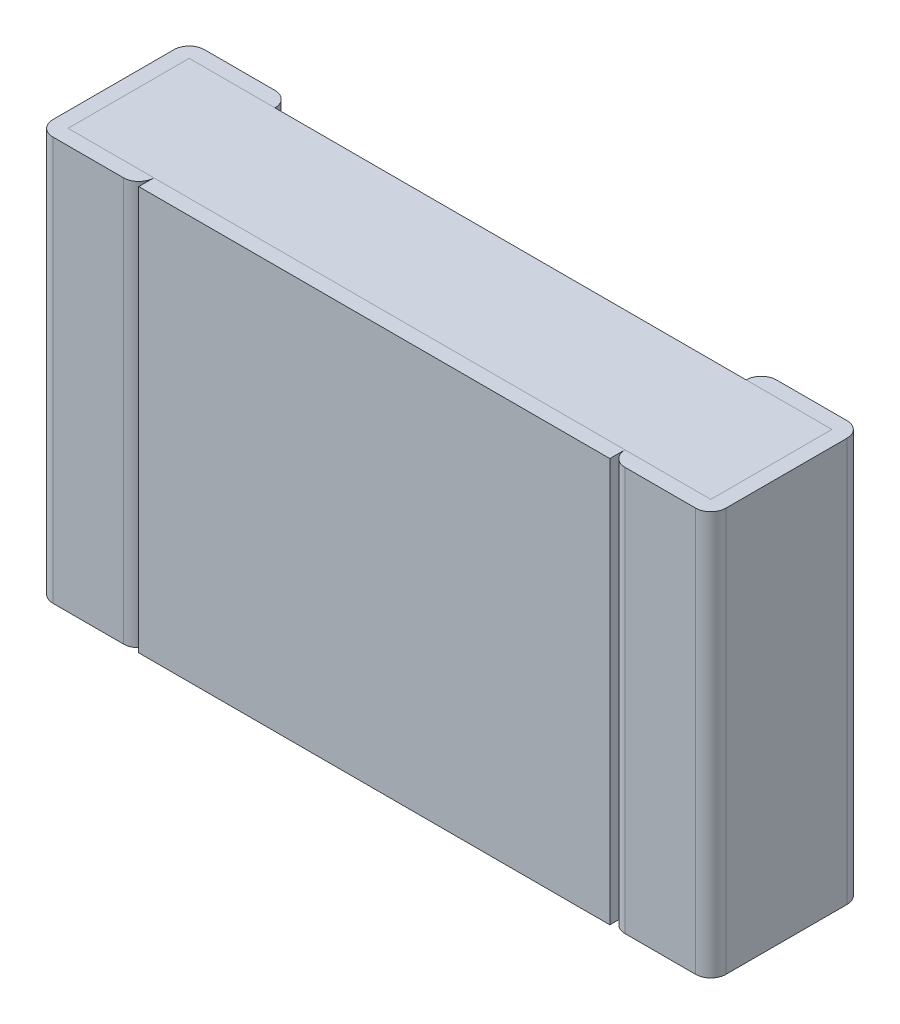
ISO-10303-21;
HEADER;
FILE_DESCRIPTION(('STEP AP214'),'2;1');
FILE_NAME('part.step','',(''),(''),'','','');
FILE_SCHEMA(('AUTOMOTIVE_DESIGN { 1 0 10303 214 1 1 1 1 }'));
ENDSEC;
DATA;
#1=APPLICATION_CONTEXT('core data for automotive mechanical design processes');
#2=APPLICATION_PROTOCOL_DEFINITION('international standard','automotive_design',2000,#1);
#3=PRODUCT_CONTEXT('',#1,'mechanical');
#4=PRODUCT('Part','Part','',(#3));
#5=PRODUCT_RELATED_PRODUCT_CATEGORY('part','',(#4));
#6=PRODUCT_DEFINITION_FORMATION('','',#4);
#7=PRODUCT_DEFINITION_CONTEXT('part definition',#1,'design');
#8=PRODUCT_DEFINITION('design','',#6,#7);
#9=PRODUCT_DEFINITION_SHAPE('','',#8);
#10=(LENGTH_UNIT() NAMED_UNIT(*) SI_UNIT(.MILLI.,.METRE.));
#11=(NAMED_UNIT(*) PLANE_ANGLE_UNIT() SI_UNIT($,.RADIAN.));
#12=(NAMED_UNIT(*) SI_UNIT($,.STERADIAN.) SOLID_ANGLE_UNIT());
#13=UNCERTAINTY_MEASURE_WITH_UNIT(LENGTH_MEASURE(1.E-05),#10,'distance_accuracy_value','');
#14=(GEOMETRIC_REPRESENTATION_CONTEXT(3) GLOBAL_UNCERTAINTY_ASSIGNED_CONTEXT((#13)) GLOBAL_UNIT_ASSIGNED_CONTEXT((#10,
#11,#12)) REPRESENTATION_CONTEXT('',''));
#15=CARTESIAN_POINT('',(0.,0.,0.));
#16=DIRECTION('',(0.,0.,1.));
#17=DIRECTION('',(1.,0.,0.));
#18=AXIS2_PLACEMENT_3D('',#15,#16,#17);
#19=CARTESIAN_POINT('',(-1.,-0.6,0.));
#20=DIRECTION('',(1.,0.,0.));
#21=DIRECTION('',(0.,1.,0.));
#22=AXIS2_PLACEMENT_3D('',#19,#20,#21);
#23=PLANE('',#22);
#24=DIRECTION('',(0.,1.,0.));
#25=VECTOR('',#24,1.);
#26=CARTESIAN_POINT('',(-1.,-0.6,0.405));
#27=LINE('',#26,#25);
#28=CARTESIAN_POINT('',(-1.,-0.6,0.405));
#29=VERTEX_POINT('',#28);
#30=CARTESIAN_POINT('',(-1.,0.6,0.405));
#31=VERTEX_POINT('',#30);
#32=EDGE_CURVE('E11',#29,#31,#27,.T.);
#33=ORIENTED_EDGE('',*,*,#32,.T.);
#34=DIRECTION('',(0.,0.,1.));
#35=VECTOR('',#34,1.);
#36=CARTESIAN_POINT('',(-1.,0.6,0.));
#37=LINE('',#36,#35);
#38=CARTESIAN_POINT('',(-1.,0.6,0.045));
#39=VERTEX_POINT('',#38);
#40=EDGE_CURVE('E40',#39,#31,#37,.T.);
#41=ORIENTED_EDGE('',*,*,#40,.F.);
#42=DIRECTION('',(0.,1.,0.));
#43=VECTOR('',#42,1.);
#44=CARTESIAN_POINT('',(-1.,-0.6,0.045));
#45=LINE('',#44,#43);
#46=CARTESIAN_POINT('',(-1.,-0.6,0.045));
#47=VERTEX_POINT('',#46);
#48=EDGE_CURVE('E267',#47,#39,#45,.T.);
#49=ORIENTED_EDGE('',*,*,#48,.F.);
#50=DIRECTION('',(0.,0.,1.));
#51=VECTOR('',#50,1.);
#52=CARTESIAN_POINT('',(-1.,-0.6,0.));
#53=LINE('',#52,#51);
#54=EDGE_CURVE('E27',#47,#29,#53,.T.);
#55=ORIENTED_EDGE('',*,*,#54,.T.);
#56=EDGE_LOOP('',(#33,#41,#49,#55));
#57=FACE_BOUND('',#56,.T.);
#58=ADVANCED_FACE('F16',(#57),#23,.F.);
#59=CARTESIAN_POINT('',(-1.,-0.6,0.));
#60=DIRECTION('',(0.,1.,0.));
#61=DIRECTION('',(1.,0.,0.));
#62=AXIS2_PLACEMENT_3D('',#59,#60,#61);
#63=PLANE('',#62);
#64=CARTESIAN_POINT('',(-0.745,-0.6,0.045));
#65=DIRECTION('',(0.,1.,0.));
#66=DIRECTION('',(0.,0.,1.));
#67=AXIS2_PLACEMENT_3D('',#64,#65,#66);
#68=CIRCLE('',#67,0.045);
#69=CARTESIAN_POINT('',(-0.7,-0.6,0.045));
#70=VERTEX_POINT('',#69);
#71=CARTESIAN_POINT('',(-0.745,-0.6,0.));
#72=VERTEX_POINT('',#71);
#73=EDGE_CURVE('E316',#70,#72,#68,.T.);
#74=ORIENTED_EDGE('',*,*,#73,.F.);
#75=DIRECTION('',(1.,0.,0.));
#76=VECTOR('',#75,1.);
#77=CARTESIAN_POINT('',(-0.955,-0.6,0.045));
#78=LINE('',#77,#76);
#79=CARTESIAN_POINT('',(-0.955,-0.6,0.045));
#80=VERTEX_POINT('',#79);
#81=EDGE_CURVE('E339',#80,#70,#78,.T.);
#82=ORIENTED_EDGE('',*,*,#81,.F.);
#83=DIRECTION('',(0.,0.,1.));
#84=VECTOR('',#83,1.);
#85=CARTESIAN_POINT('',(-0.955,-0.6,0.045));
#86=LINE('',#85,#84);
#87=CARTESIAN_POINT('',(-0.955,-0.6,0.405));
#88=VERTEX_POINT('',#87);
#89=EDGE_CURVE('E324',#80,#88,#86,.T.);
#90=ORIENTED_EDGE('',*,*,#89,.T.);
#91=DIRECTION('',(1.,0.,0.));
#92=VECTOR('',#91,1.);
#93=CARTESIAN_POINT('',(-0.955,-0.6,0.405));
#94=LINE('',#93,#92);
#95=CARTESIAN_POINT('',(-0.7,-0.6,0.405));
#96=VERTEX_POINT('',#95);
#97=EDGE_CURVE('E327',#88,#96,#94,.T.);
#98=ORIENTED_EDGE('',*,*,#97,.T.);
#99=CARTESIAN_POINT('',(-0.745,-0.6,0.405));
#100=DIRECTION('',(0.,-1.,0.));
#101=DIRECTION('',(0.,0.,1.));
#102=AXIS2_PLACEMENT_3D('',#99,#100,#101);
#103=CIRCLE('',#102,0.045);
#104=CARTESIAN_POINT('',(-0.745,-0.6,0.45));
#105=VERTEX_POINT('',#104);
#106=EDGE_CURVE('E345',#96,#105,#103,.T.);
#107=ORIENTED_EDGE('',*,*,#106,.T.);
#108=DIRECTION('',(1.,0.,0.));
#109=VECTOR('',#108,1.);
#110=CARTESIAN_POINT('',(-1.,-0.6,0.45));
#111=LINE('',#110,#109);
#112=CARTESIAN_POINT('',(-0.955,-0.6,0.45));
#113=VERTEX_POINT('',#112);
#114=EDGE_CURVE('E337',#113,#105,#111,.T.);
#115=ORIENTED_EDGE('',*,*,#114,.F.);
#116=CARTESIAN_POINT('',(-0.955,-0.6,0.405));
#117=DIRECTION('',(0.,1.,0.));
#118=DIRECTION('',(0.,0.,1.));
#119=AXIS2_PLACEMENT_3D('',#116,#117,#118);
#120=CIRCLE('',#119,0.045);
#121=EDGE_CURVE('E351',#29,#113,#120,.T.);
#122=ORIENTED_EDGE('',*,*,#121,.F.);
#123=ORIENTED_EDGE('',*,*,#54,.F.);
#124=CARTESIAN_POINT('',(-0.955,-0.6,0.045));
#125=DIRECTION('',(0.,-1.,0.));
#126=DIRECTION('',(0.,0.,1.));
#127=AXIS2_PLACEMENT_3D('',#124,#125,#126);
#128=CIRCLE('',#127,0.045);
#129=CARTESIAN_POINT('',(-0.955,-0.6,0.));
#130=VERTEX_POINT('',#129);
#131=EDGE_CURVE('E266',#47,#130,#128,.T.);
#132=ORIENTED_EDGE('',*,*,#131,.T.);
#133=DIRECTION('',(1.,0.,0.));
#134=VECTOR('',#133,1.);
#135=CARTESIAN_POINT('',(-1.,-0.6,0.));
#136=LINE('',#135,#134);
#137=EDGE_CURVE('E262',#130,#72,#136,.T.);
#138=ORIENTED_EDGE('',*,*,#137,.T.);
#139=EDGE_LOOP('',(#74,#82,#90,#98,#107,#115,#122,#123,#132,#138));
#140=FACE_BOUND('',#139,.T.);
#141=ADVANCED_FACE('F457',(#140),#63,.F.);
#142=CARTESIAN_POINT('',(-0.955,-0.6,0.045));
#143=DIRECTION('',(0.,1.,0.));
#144=DIRECTION('',(-1.,0.,0.));
#145=AXIS2_PLACEMENT_3D('',#142,#143,#144);
#146=CYLINDRICAL_SURFACE('',#145,0.045);
#147=ORIENTED_EDGE('',*,*,#48,.T.);
#148=CARTESIAN_POINT('',(-0.955,0.6,0.045));
#149=DIRECTION('',(0.,-1.,0.));
#150=DIRECTION('',(0.,0.,1.));
#151=AXIS2_PLACEMENT_3D('',#148,#149,#150);
#152=CIRCLE('',#151,0.045);
#153=CARTESIAN_POINT('',(-0.955,0.6,0.));
#154=VERTEX_POINT('',#153);
#155=EDGE_CURVE('E354',#39,#154,#152,.T.);
#156=ORIENTED_EDGE('',*,*,#155,.T.);
#157=DIRECTION('',(0.,1.,0.));
#158=VECTOR('',#157,1.);
#159=CARTESIAN_POINT('',(-0.955,-0.6,0.));
#160=LINE('',#159,#158);
#161=EDGE_CURVE('E307',#130,#154,#160,.T.);
#162=ORIENTED_EDGE('',*,*,#161,.F.);
#163=ORIENTED_EDGE('',*,*,#131,.F.);
#164=EDGE_LOOP('',(#147,#156,#162,#163));
#165=FACE_BOUND('',#164,.T.);
#166=ADVANCED_FACE('F462',(#165),#146,.T.);
#167=CARTESIAN_POINT('',(-0.955,-0.6,0.405));
#168=DIRECTION('',(0.,1.,0.));
#169=DIRECTION('',(-1.,0.,0.));
#170=AXIS2_PLACEMENT_3D('',#167,#168,#169);
#171=CYLINDRICAL_SURFACE('',#170,0.045);
#172=ORIENTED_EDGE('',*,*,#121,.T.);
#173=DIRECTION('',(0.,1.,0.));
#174=VECTOR('',#173,1.);
#175=CARTESIAN_POINT('',(-0.955,-0.6,0.45));
#176=LINE('',#175,#174);
#177=CARTESIAN_POINT('',(-0.955,0.6,0.45));
#178=VERTEX_POINT('',#177);
#179=EDGE_CURVE('E355',#113,#178,#176,.T.);
#180=ORIENTED_EDGE('',*,*,#179,.T.);
#181=CARTESIAN_POINT('',(-0.955,0.6,0.405));
#182=DIRECTION('',(0.,1.,0.));
#183=DIRECTION('',(0.,0.,1.));
#184=AXIS2_PLACEMENT_3D('',#181,#182,#183);
#185=CIRCLE('',#184,0.045);
#186=EDGE_CURVE('E268',#31,#178,#185,.T.);
#187=ORIENTED_EDGE('',*,*,#186,.F.);
#188=ORIENTED_EDGE('',*,*,#32,.F.);
#189=EDGE_LOOP('',(#172,#180,#187,#188));
#190=FACE_BOUND('',#189,.T.);
#191=ADVANCED_FACE('F467',(#190),#171,.T.);
#192=CARTESIAN_POINT('',(-1.,0.6,0.));
#193=DIRECTION('',(0.,1.,0.));
#194=DIRECTION('',(1.,0.,0.));
#195=AXIS2_PLACEMENT_3D('',#192,#193,#194);
#196=PLANE('',#195);
#197=DIRECTION('',(1.,0.,0.));
#198=VECTOR('',#197,1.);
#199=CARTESIAN_POINT('',(-1.,0.6,0.));
#200=LINE('',#199,#198);
#201=CARTESIAN_POINT('',(-0.745,0.6,0.));
#202=VERTEX_POINT('',#201);
#203=EDGE_CURVE('E311',#154,#202,#200,.T.);
#204=ORIENTED_EDGE('',*,*,#203,.F.);
#205=ORIENTED_EDGE('',*,*,#155,.F.);
#206=ORIENTED_EDGE('',*,*,#40,.T.);
#207=ORIENTED_EDGE('',*,*,#186,.T.);
#208=DIRECTION('',(1.,0.,0.));
#209=VECTOR('',#208,1.);
#210=CARTESIAN_POINT('',(-1.,0.6,0.45));
#211=LINE('',#210,#209);
#212=CARTESIAN_POINT('',(-0.745,0.6,0.45));
#213=VERTEX_POINT('',#212);
#214=EDGE_CURVE('E271',#178,#213,#211,.T.);
#215=ORIENTED_EDGE('',*,*,#214,.T.);
#216=CARTESIAN_POINT('',(-0.745,0.6,0.405));
#217=DIRECTION('',(0.,-1.,0.));
#218=DIRECTION('',(0.,0.,1.));
#219=AXIS2_PLACEMENT_3D('',#216,#217,#218);
#220=CIRCLE('',#219,0.045);
#221=CARTESIAN_POINT('',(-0.7,0.6,0.405));
#222=VERTEX_POINT('',#221);
#223=EDGE_CURVE('E381',#222,#213,#220,.T.);
#224=ORIENTED_EDGE('',*,*,#223,.F.);
#225=DIRECTION('',(1.,0.,0.));
#226=VECTOR('',#225,1.);
#227=CARTESIAN_POINT('',(-0.955,0.6,0.405));
#228=LINE('',#227,#226);
#229=CARTESIAN_POINT('',(-0.955,0.6,0.405));
#230=VERTEX_POINT('',#229);
#231=EDGE_CURVE('E418',#230,#222,#228,.T.);
#232=ORIENTED_EDGE('',*,*,#231,.F.);
#233=DIRECTION('',(0.,0.,1.));
#234=VECTOR('',#233,1.);
#235=CARTESIAN_POINT('',(-0.955,0.6,0.045));
#236=LINE('',#235,#234);
#237=CARTESIAN_POINT('',(-0.955,0.6,0.045));
#238=VERTEX_POINT('',#237);
#239=EDGE_CURVE('E385',#238,#230,#236,.T.);
#240=ORIENTED_EDGE('',*,*,#239,.F.);
#241=DIRECTION('',(1.,0.,0.));
#242=VECTOR('',#241,1.);
#243=CARTESIAN_POINT('',(-0.955,0.6,0.045));
#244=LINE('',#243,#242);
#245=CARTESIAN_POINT('',(-0.7,0.6,0.045));
#246=VERTEX_POINT('',#245);
#247=EDGE_CURVE('E312',#238,#246,#244,.T.);
#248=ORIENTED_EDGE('',*,*,#247,.T.);
#249=CARTESIAN_POINT('',(-0.745,0.6,0.045));
#250=DIRECTION('',(0.,1.,0.));
#251=DIRECTION('',(0.,0.,1.));
#252=AXIS2_PLACEMENT_3D('',#249,#250,#251);
#253=CIRCLE('',#252,0.045);
#254=EDGE_CURVE('E310',#246,#202,#253,.T.);
#255=ORIENTED_EDGE('',*,*,#254,.T.);
#256=EDGE_LOOP('',(#204,#205,#206,#207,#215,#224,#232,#240,#248,#255));
#257=FACE_BOUND('',#256,.T.);
#258=ADVANCED_FACE('F18',(#257),#196,.T.);
#259=CARTESIAN_POINT('',(-1.,-0.6,0.));
#260=DIRECTION('',(0.,0.,1.));
#261=DIRECTION('',(1.,0.,0.));
#262=AXIS2_PLACEMENT_3D('',#259,#260,#261);
#263=PLANE('',#262);
#264=DIRECTION('',(0.,1.,0.));
#265=VECTOR('',#264,1.);
#266=CARTESIAN_POINT('',(-0.745,-0.6,0.));
#267=LINE('',#266,#265);
#268=EDGE_CURVE('E318',#72,#202,#267,.T.);
#269=ORIENTED_EDGE('',*,*,#268,.F.);
#270=ORIENTED_EDGE('',*,*,#137,.F.);
#271=ORIENTED_EDGE('',*,*,#161,.T.);
#272=ORIENTED_EDGE('',*,*,#203,.T.);
#273=EDGE_LOOP('',(#269,#270,#271,#272));
#274=FACE_BOUND('',#273,.T.);
#275=ADVANCED_FACE('F443',(#274),#263,.F.);
#276=CARTESIAN_POINT('',(-0.745,-0.6,0.045));
#277=DIRECTION('',(0.,1.,0.));
#278=DIRECTION('',(1.,0.,0.));
#279=AXIS2_PLACEMENT_3D('',#276,#277,#278);
#280=CYLINDRICAL_SURFACE('',#279,0.045);
#281=ORIENTED_EDGE('',*,*,#73,.T.);
#282=ORIENTED_EDGE('',*,*,#268,.T.);
#283=ORIENTED_EDGE('',*,*,#254,.F.);
#284=DIRECTION('',(0.,1.,0.));
#285=VECTOR('',#284,1.);
#286=CARTESIAN_POINT('',(-0.7,-0.6,0.045));
#287=LINE('',#286,#285);
#288=EDGE_CURVE('E346',#70,#246,#287,.T.);
#289=ORIENTED_EDGE('',*,*,#288,.F.);
#290=EDGE_LOOP('',(#281,#282,#283,#289));
#291=FACE_BOUND('',#290,.T.);
#292=ADVANCED_FACE('F452',(#291),#280,.T.);
#293=CARTESIAN_POINT('',(-0.955,-0.6,0.045));
#294=DIRECTION('',(0.,1.,0.));
#295=DIRECTION('',(1.,0.,0.));
#296=AXIS2_PLACEMENT_3D('',#293,#294,#295);
#297=PLANE('',#296);
#298=DIRECTION('',(1.,0.,0.));
#299=VECTOR('',#298,1.);
#300=CARTESIAN_POINT('',(-0.955,-0.6,0.045));
#301=LINE('',#300,#299);
#302=CARTESIAN_POINT('',(0.7,-0.6,0.045));
#303=VERTEX_POINT('',#302);
#304=EDGE_CURVE('E250',#70,#303,#301,.T.);
#305=ORIENTED_EDGE('',*,*,#304,.T.);
#306=DIRECTION('',(1.,0.,0.));
#307=VECTOR('',#306,1.);
#308=CARTESIAN_POINT('',(-0.955,-0.6,0.045));
#309=LINE('',#308,#307);
#310=CARTESIAN_POINT('',(0.955,-0.6,0.045));
#311=VERTEX_POINT('',#310);
#312=EDGE_CURVE('E226',#303,#311,#309,.T.);
#313=ORIENTED_EDGE('',*,*,#312,.T.);
#314=DIRECTION('',(0.,0.,1.));
#315=VECTOR('',#314,1.);
#316=CARTESIAN_POINT('',(0.955,-0.6,0.045));
#317=LINE('',#316,#315);
#318=CARTESIAN_POINT('',(0.955,-0.6,0.405));
#319=VERTEX_POINT('',#318);
#320=EDGE_CURVE('E251',#311,#319,#317,.T.);
#321=ORIENTED_EDGE('',*,*,#320,.T.);
#322=DIRECTION('',(1.,0.,0.));
#323=VECTOR('',#322,1.);
#324=CARTESIAN_POINT('',(-0.955,-0.6,0.405));
#325=LINE('',#324,#323);
#326=CARTESIAN_POINT('',(0.7,-0.6,0.405));
#327=VERTEX_POINT('',#326);
#328=EDGE_CURVE('E230',#327,#319,#325,.T.);
#329=ORIENTED_EDGE('',*,*,#328,.F.);
#330=DIRECTION('',(1.,0.,0.));
#331=VECTOR('',#330,1.);
#332=CARTESIAN_POINT('',(-0.7,-0.6,0.405));
#333=LINE('',#332,#331);
#334=EDGE_CURVE('E372',#96,#327,#333,.T.);
#335=ORIENTED_EDGE('',*,*,#334,.F.);
#336=ORIENTED_EDGE('',*,*,#97,.F.);
#337=ORIENTED_EDGE('',*,*,#89,.F.);
#338=ORIENTED_EDGE('',*,*,#81,.T.);
#339=EDGE_LOOP('',(#305,#313,#321,#329,#335,#336,#337,#338));
#340=FACE_BOUND('',#339,.T.);
#341=ADVANCED_FACE('F538',(#340),#297,.F.);
#342=CARTESIAN_POINT('',(-1.,-0.6,0.45));
#343=DIRECTION('',(0.,0.,1.));
#344=DIRECTION('',(1.,0.,0.));
#345=AXIS2_PLACEMENT_3D('',#342,#343,#344);
#346=PLANE('',#345);
#347=ORIENTED_EDGE('',*,*,#214,.F.);
#348=ORIENTED_EDGE('',*,*,#179,.F.);
#349=ORIENTED_EDGE('',*,*,#114,.T.);
#350=DIRECTION('',(0.,1.,0.));
#351=VECTOR('',#350,1.);
#352=CARTESIAN_POINT('',(-0.745,-0.6,0.45));
#353=LINE('',#352,#351);
#354=EDGE_CURVE('E340',#105,#213,#353,.T.);
#355=ORIENTED_EDGE('',*,*,#354,.T.);
#356=EDGE_LOOP('',(#347,#348,#349,#355));
#357=FACE_BOUND('',#356,.T.);
#358=ADVANCED_FACE('F473',(#357),#346,.T.);
#359=CARTESIAN_POINT('',(-0.745,-0.6,0.405));
#360=DIRECTION('',(0.,1.,0.));
#361=DIRECTION('',(1.,0.,0.));
#362=AXIS2_PLACEMENT_3D('',#359,#360,#361);
#363=CYLINDRICAL_SURFACE('',#362,0.045);
#364=DIRECTION('',(0.,1.,0.));
#365=VECTOR('',#364,1.);
#366=CARTESIAN_POINT('',(-0.7,-0.6,0.405));
#367=LINE('',#366,#365);
#368=EDGE_CURVE('E384',#96,#222,#367,.T.);
#369=ORIENTED_EDGE('',*,*,#368,.T.);
#370=ORIENTED_EDGE('',*,*,#223,.T.);
#371=ORIENTED_EDGE('',*,*,#354,.F.);
#372=ORIENTED_EDGE('',*,*,#106,.F.);
#373=EDGE_LOOP('',(#369,#370,#371,#372));
#374=FACE_BOUND('',#373,.T.);
#375=ADVANCED_FACE('F477',(#374),#363,.T.);
#376=CARTESIAN_POINT('',(-0.955,0.6,0.045));
#377=DIRECTION('',(0.,1.,0.));
#378=DIRECTION('',(1.,0.,0.));
#379=AXIS2_PLACEMENT_3D('',#376,#377,#378);
#380=PLANE('',#379);
#381=ORIENTED_EDGE('',*,*,#247,.F.);
#382=ORIENTED_EDGE('',*,*,#239,.T.);
#383=ORIENTED_EDGE('',*,*,#231,.T.);
#384=DIRECTION('',(1.,0.,0.));
#385=VECTOR('',#384,1.);
#386=CARTESIAN_POINT('',(-0.7,0.6,0.405));
#387=LINE('',#386,#385);
#388=CARTESIAN_POINT('',(0.7,0.6,0.405));
#389=VERTEX_POINT('',#388);
#390=EDGE_CURVE('E411',#222,#389,#387,.T.);
#391=ORIENTED_EDGE('',*,*,#390,.T.);
#392=DIRECTION('',(1.,0.,0.));
#393=VECTOR('',#392,1.);
#394=CARTESIAN_POINT('',(-0.955,0.6,0.405));
#395=LINE('',#394,#393);
#396=CARTESIAN_POINT('',(0.955,0.6,0.405));
#397=VERTEX_POINT('',#396);
#398=EDGE_CURVE('E368',#389,#397,#395,.T.);
#399=ORIENTED_EDGE('',*,*,#398,.T.);
#400=DIRECTION('',(0.,0.,1.));
#401=VECTOR('',#400,1.);
#402=CARTESIAN_POINT('',(0.955,0.6,0.045));
#403=LINE('',#402,#401);
#404=CARTESIAN_POINT('',(0.955,0.6,0.045));
#405=VERTEX_POINT('',#404);
#406=EDGE_CURVE('E286',#405,#397,#403,.T.);
#407=ORIENTED_EDGE('',*,*,#406,.F.);
#408=DIRECTION('',(1.,0.,0.));
#409=VECTOR('',#408,1.);
#410=CARTESIAN_POINT('',(-0.955,0.6,0.045));
#411=LINE('',#410,#409);
#412=CARTESIAN_POINT('',(0.7,0.6,0.045));
#413=VERTEX_POINT('',#412);
#414=EDGE_CURVE('E303',#413,#405,#411,.T.);
#415=ORIENTED_EDGE('',*,*,#414,.F.);
#416=DIRECTION('',(1.,0.,0.));
#417=VECTOR('',#416,1.);
#418=CARTESIAN_POINT('',(-0.955,0.6,0.045));
#419=LINE('',#418,#417);
#420=EDGE_CURVE('E349',#246,#413,#419,.T.);
#421=ORIENTED_EDGE('',*,*,#420,.F.);
#422=EDGE_LOOP('',(#381,#382,#383,#391,#399,#407,#415,#421));
#423=FACE_BOUND('',#422,.T.);
#424=ADVANCED_FACE('F490',(#423),#380,.T.);
#425=CARTESIAN_POINT('',(-0.955,-0.6,0.045));
#426=DIRECTION('',(0.,0.,1.));
#427=DIRECTION('',(1.,0.,0.));
#428=AXIS2_PLACEMENT_3D('',#425,#426,#427);
#429=PLANE('',#428);
#430=ORIENTED_EDGE('',*,*,#420,.T.);
#431=DIRECTION('',(0.,1.,0.));
#432=VECTOR('',#431,1.);
#433=CARTESIAN_POINT('',(0.7,-0.6,0.045));
#434=LINE('',#433,#432);
#435=EDGE_CURVE('E242',#303,#413,#434,.T.);
#436=ORIENTED_EDGE('',*,*,#435,.F.);
#437=ORIENTED_EDGE('',*,*,#304,.F.);
#438=ORIENTED_EDGE('',*,*,#288,.T.);
#439=EDGE_LOOP('',(#430,#436,#437,#438));
#440=FACE_BOUND('',#439,.T.);
#441=ADVANCED_FACE('F493',(#440),#429,.F.);
#442=CARTESIAN_POINT('',(0.7,-0.6,0.));
#443=DIRECTION('',(0.,1.,0.));
#444=DIRECTION('',(1.,0.,0.));
#445=AXIS2_PLACEMENT_3D('',#442,#443,#444);
#446=PLANE('',#445);
#447=CARTESIAN_POINT('',(0.955,-0.6,0.045));
#448=DIRECTION('',(0.,1.,0.));
#449=DIRECTION('',(0.,0.,1.));
#450=AXIS2_PLACEMENT_3D('',#447,#448,#449);
#451=CIRCLE('',#450,0.045);
#452=CARTESIAN_POINT('',(1.,-0.6,0.045));
#453=VERTEX_POINT('',#452);
#454=CARTESIAN_POINT('',(0.955,-0.6,0.));
#455=VERTEX_POINT('',#454);
#456=EDGE_CURVE('E245',#453,#455,#451,.T.);
#457=ORIENTED_EDGE('',*,*,#456,.F.);
#458=DIRECTION('',(0.,0.,1.));
#459=VECTOR('',#458,1.);
#460=CARTESIAN_POINT('',(1.,-0.6,0.));
#461=LINE('',#460,#459);
#462=CARTESIAN_POINT('',(1.,-0.6,0.405));
#463=VERTEX_POINT('',#462);
#464=EDGE_CURVE('E350',#453,#463,#461,.T.);
#465=ORIENTED_EDGE('',*,*,#464,.T.);
#466=CARTESIAN_POINT('',(0.955,-0.6,0.405));
#467=DIRECTION('',(0.,-1.,0.));
#468=DIRECTION('',(0.,0.,1.));
#469=AXIS2_PLACEMENT_3D('',#466,#467,#468);
#470=CIRCLE('',#469,0.045);
#471=CARTESIAN_POINT('',(0.955,-0.6,0.45));
#472=VERTEX_POINT('',#471);
#473=EDGE_CURVE('E274',#463,#472,#470,.T.);
#474=ORIENTED_EDGE('',*,*,#473,.T.);
#475=DIRECTION('',(1.,0.,0.));
#476=VECTOR('',#475,1.);
#477=CARTESIAN_POINT('',(0.7,-0.6,0.45));
#478=LINE('',#477,#476);
#479=CARTESIAN_POINT('',(0.745,-0.6,0.45));
#480=VERTEX_POINT('',#479);
#481=EDGE_CURVE('E255',#480,#472,#478,.T.);
#482=ORIENTED_EDGE('',*,*,#481,.F.);
#483=CARTESIAN_POINT('',(0.745,-0.6,0.405));
#484=DIRECTION('',(0.,1.,0.));
#485=DIRECTION('',(0.,0.,1.));
#486=AXIS2_PLACEMENT_3D('',#483,#484,#485);
#487=CIRCLE('',#486,0.045);
#488=EDGE_CURVE('E301',#327,#480,#487,.T.);
#489=ORIENTED_EDGE('',*,*,#488,.F.);
#490=ORIENTED_EDGE('',*,*,#328,.T.);
#491=ORIENTED_EDGE('',*,*,#320,.F.);
#492=ORIENTED_EDGE('',*,*,#312,.F.);
#493=CARTESIAN_POINT('',(0.745,-0.6,0.045));
#494=DIRECTION('',(0.,-1.,0.));
#495=DIRECTION('',(0.,0.,1.));
#496=AXIS2_PLACEMENT_3D('',#493,#494,#495);
#497=CIRCLE('',#496,0.045);
#498=CARTESIAN_POINT('',(0.745,-0.6,0.));
#499=VERTEX_POINT('',#498);
#500=EDGE_CURVE('E219',#303,#499,#497,.T.);
#501=ORIENTED_EDGE('',*,*,#500,.T.);
#502=DIRECTION('',(1.,0.,0.));
#503=VECTOR('',#502,1.);
#504=CARTESIAN_POINT('',(0.7,-0.6,0.));
#505=LINE('',#504,#503);
#506=EDGE_CURVE('E211',#499,#455,#505,.T.);
#507=ORIENTED_EDGE('',*,*,#506,.T.);
#508=EDGE_LOOP('',(#457,#465,#474,#482,#489,#490,#491,#492,#501,#507));
#509=FACE_BOUND('',#508,.T.);
#510=ADVANCED_FACE('F224',(#509),#446,.F.);
#511=CARTESIAN_POINT('',(-0.7,-0.6,0.405));
#512=DIRECTION('',(0.,1.,0.));
#513=DIRECTION('',(1.,0.,0.));
#514=AXIS2_PLACEMENT_3D('',#511,#512,#513);
#515=PLANE('',#514);
#516=DIRECTION('',(0.,0.,1.));
#517=VECTOR('',#516,1.);
#518=CARTESIAN_POINT('',(0.7,-0.6,0.405));
#519=LINE('',#518,#517);
#520=CARTESIAN_POINT('',(0.7,-0.6,0.45));
#521=VERTEX_POINT('',#520);
#522=EDGE_CURVE('E220',#327,#521,#519,.T.);
#523=ORIENTED_EDGE('',*,*,#522,.T.);
#524=DIRECTION('',(1.,0.,0.));
#525=VECTOR('',#524,1.);
#526=CARTESIAN_POINT('',(-0.7,-0.6,0.45));
#527=LINE('',#526,#525);
#528=CARTESIAN_POINT('',(-0.7,-0.6,0.45));
#529=VERTEX_POINT('',#528);
#530=EDGE_CURVE('E380',#529,#521,#527,.T.);
#531=ORIENTED_EDGE('',*,*,#530,.F.);
#532=DIRECTION('',(0.,0.,1.));
#533=VECTOR('',#532,1.);
#534=CARTESIAN_POINT('',(-0.7,-0.6,0.405));
#535=LINE('',#534,#533);
#536=EDGE_CURVE('E306',#96,#529,#535,.T.);
#537=ORIENTED_EDGE('',*,*,#536,.F.);
#538=ORIENTED_EDGE('',*,*,#334,.T.);
#539=EDGE_LOOP('',(#523,#531,#537,#538));
#540=FACE_BOUND('',#539,.T.);
#541=ADVANCED_FACE('F542',(#540),#515,.F.);
#542=CARTESIAN_POINT('',(-0.7,-0.6,0.405));
#543=DIRECTION('',(1.,0.,0.));
#544=DIRECTION('',(0.,1.,0.));
#545=AXIS2_PLACEMENT_3D('',#542,#543,#544);
#546=PLANE('',#545);
#547=DIRECTION('',(0.,1.,0.));
#548=VECTOR('',#547,1.);
#549=CARTESIAN_POINT('',(-0.7,-0.6,0.45));
#550=LINE('',#549,#548);
#551=CARTESIAN_POINT('',(-0.7,0.6,0.45));
#552=VERTEX_POINT('',#551);
#553=EDGE_CURVE('E323',#529,#552,#550,.T.);
#554=ORIENTED_EDGE('',*,*,#553,.T.);
#555=DIRECTION('',(0.,0.,1.));
#556=VECTOR('',#555,1.);
#557=CARTESIAN_POINT('',(-0.7,0.6,0.405));
#558=LINE('',#557,#556);
#559=EDGE_CURVE('E290',#222,#552,#558,.T.);
#560=ORIENTED_EDGE('',*,*,#559,.F.);
#561=ORIENTED_EDGE('',*,*,#368,.F.);
#562=ORIENTED_EDGE('',*,*,#536,.T.);
#563=EDGE_LOOP('',(#554,#560,#561,#562));
#564=FACE_BOUND('',#563,.T.);
#565=ADVANCED_FACE('F482',(#564),#546,.F.);
#566=CARTESIAN_POINT('',(0.7,0.6,0.));
#567=DIRECTION('',(0.,1.,0.));
#568=DIRECTION('',(1.,0.,0.));
#569=AXIS2_PLACEMENT_3D('',#566,#567,#568);
#570=PLANE('',#569);
#571=DIRECTION('',(1.,0.,0.));
#572=VECTOR('',#571,1.);
#573=CARTESIAN_POINT('',(0.7,0.6,0.));
#574=LINE('',#573,#572);
#575=CARTESIAN_POINT('',(0.745,0.6,0.));
#576=VERTEX_POINT('',#575);
#577=CARTESIAN_POINT('',(0.955,0.6,0.));
#578=VERTEX_POINT('',#577);
#579=EDGE_CURVE('E237',#576,#578,#574,.T.);
#580=ORIENTED_EDGE('',*,*,#579,.F.);
#581=CARTESIAN_POINT('',(0.745,0.6,0.045));
#582=DIRECTION('',(0.,-1.,0.));
#583=DIRECTION('',(0.,0.,1.));
#584=AXIS2_PLACEMENT_3D('',#581,#582,#583);
#585=CIRCLE('',#584,0.045);
#586=EDGE_CURVE('E235',#413,#576,#585,.T.);
#587=ORIENTED_EDGE('',*,*,#586,.F.);
#588=ORIENTED_EDGE('',*,*,#414,.T.);
#589=ORIENTED_EDGE('',*,*,#406,.T.);
#590=ORIENTED_EDGE('',*,*,#398,.F.);
#591=CARTESIAN_POINT('',(0.745,0.6,0.405));
#592=DIRECTION('',(0.,1.,0.));
#593=DIRECTION('',(0.,0.,1.));
#594=AXIS2_PLACEMENT_3D('',#591,#592,#593);
#595=CIRCLE('',#594,0.045);
#596=CARTESIAN_POINT('',(0.745,0.6,0.45));
#597=VERTEX_POINT('',#596);
#598=EDGE_CURVE('E278',#389,#597,#595,.T.);
#599=ORIENTED_EDGE('',*,*,#598,.T.);
#600=DIRECTION('',(1.,0.,0.));
#601=VECTOR('',#600,1.);
#602=CARTESIAN_POINT('',(0.7,0.6,0.45));
#603=LINE('',#602,#601);
#604=CARTESIAN_POINT('',(0.955,0.6,0.45));
#605=VERTEX_POINT('',#604);
#606=EDGE_CURVE('E275',#597,#605,#603,.T.);
#607=ORIENTED_EDGE('',*,*,#606,.T.);
#608=CARTESIAN_POINT('',(0.955,0.6,0.405));
#609=DIRECTION('',(0.,-1.,0.));
#610=DIRECTION('',(0.,0.,1.));
#611=AXIS2_PLACEMENT_3D('',#608,#609,#610);
#612=CIRCLE('',#611,0.045);
#613=CARTESIAN_POINT('',(1.,0.6,0.405));
#614=VERTEX_POINT('',#613);
#615=EDGE_CURVE('E252',#614,#605,#612,.T.);
#616=ORIENTED_EDGE('',*,*,#615,.F.);
#617=DIRECTION('',(0.,0.,1.));
#618=VECTOR('',#617,1.);
#619=CARTESIAN_POINT('',(1.,0.6,0.));
#620=LINE('',#619,#618);
#621=CARTESIAN_POINT('',(1.,0.6,0.045));
#622=VERTEX_POINT('',#621);
#623=EDGE_CURVE('E257',#622,#614,#620,.T.);
#624=ORIENTED_EDGE('',*,*,#623,.F.);
#625=CARTESIAN_POINT('',(0.955,0.6,0.045));
#626=DIRECTION('',(0.,1.,0.));
#627=DIRECTION('',(0.,0.,1.));
#628=AXIS2_PLACEMENT_3D('',#625,#626,#627);
#629=CIRCLE('',#628,0.045);
#630=EDGE_CURVE('E279',#622,#578,#629,.T.);
#631=ORIENTED_EDGE('',*,*,#630,.T.);
#632=EDGE_LOOP('',(#580,#587,#588,#589,#590,#599,#607,#616,#624,#631));
#633=FACE_BOUND('',#632,.T.);
#634=ADVANCED_FACE('F494',(#633),#570,.T.);
#635=CARTESIAN_POINT('',(-0.7,0.6,0.405));
#636=DIRECTION('',(0.,1.,0.));
#637=DIRECTION('',(1.,0.,0.));
#638=AXIS2_PLACEMENT_3D('',#635,#636,#637);
#639=PLANE('',#638);
#640=ORIENTED_EDGE('',*,*,#390,.F.);
#641=ORIENTED_EDGE('',*,*,#559,.T.);
#642=DIRECTION('',(1.,0.,0.));
#643=VECTOR('',#642,1.);
#644=CARTESIAN_POINT('',(-0.7,0.6,0.45));
#645=LINE('',#644,#643);
#646=CARTESIAN_POINT('',(0.7,0.6,0.45));
#647=VERTEX_POINT('',#646);
#648=EDGE_CURVE('E297',#552,#647,#645,.T.);
#649=ORIENTED_EDGE('',*,*,#648,.T.);
#650=DIRECTION('',(0.,0.,1.));
#651=VECTOR('',#650,1.);
#652=CARTESIAN_POINT('',(0.7,0.6,0.405));
#653=LINE('',#652,#651);
#654=EDGE_CURVE('E336',#389,#647,#653,.T.);
#655=ORIENTED_EDGE('',*,*,#654,.F.);
#656=EDGE_LOOP('',(#640,#641,#649,#655));
#657=FACE_BOUND('',#656,.T.);
#658=ADVANCED_FACE('F487',(#657),#639,.T.);
#659=CARTESIAN_POINT('',(0.745,-0.6,0.045));
#660=DIRECTION('',(0.,1.,0.));
#661=DIRECTION('',(-1.,0.,0.));
#662=AXIS2_PLACEMENT_3D('',#659,#660,#661);
#663=CYLINDRICAL_SURFACE('',#662,0.045);
#664=ORIENTED_EDGE('',*,*,#435,.T.);
#665=ORIENTED_EDGE('',*,*,#586,.T.);
#666=DIRECTION('',(0.,1.,0.));
#667=VECTOR('',#666,1.);
#668=CARTESIAN_POINT('',(0.745,-0.6,0.));
#669=LINE('',#668,#667);
#670=EDGE_CURVE('E215',#499,#576,#669,.T.);
#671=ORIENTED_EDGE('',*,*,#670,.F.);
#672=ORIENTED_EDGE('',*,*,#500,.F.);
#673=EDGE_LOOP('',(#664,#665,#671,#672));
#674=FACE_BOUND('',#673,.T.);
#675=ADVANCED_FACE('F233',(#674),#663,.T.);
#676=CARTESIAN_POINT('',(0.7,-0.6,0.));
#677=DIRECTION('',(0.,0.,1.));
#678=DIRECTION('',(1.,0.,0.));
#679=AXIS2_PLACEMENT_3D('',#676,#677,#678);
#680=PLANE('',#679);
#681=DIRECTION('',(0.,1.,0.));
#682=VECTOR('',#681,1.);
#683=CARTESIAN_POINT('',(0.955,-0.6,0.));
#684=LINE('',#683,#682);
#685=EDGE_CURVE('E20',#455,#578,#684,.T.);
#686=ORIENTED_EDGE('',*,*,#685,.F.);
#687=ORIENTED_EDGE('',*,*,#506,.F.);
#688=ORIENTED_EDGE('',*,*,#670,.T.);
#689=ORIENTED_EDGE('',*,*,#579,.T.);
#690=EDGE_LOOP('',(#686,#687,#688,#689));
#691=FACE_BOUND('',#690,.T.);
#692=ADVANCED_FACE('F213',(#691),#680,.F.);
#693=CARTESIAN_POINT('',(0.955,-0.6,0.045));
#694=DIRECTION('',(0.,1.,0.));
#695=DIRECTION('',(1.,0.,0.));
#696=AXIS2_PLACEMENT_3D('',#693,#694,#695);
#697=CYLINDRICAL_SURFACE('',#696,0.045);
#698=ORIENTED_EDGE('',*,*,#456,.T.);
#699=ORIENTED_EDGE('',*,*,#685,.T.);
#700=ORIENTED_EDGE('',*,*,#630,.F.);
#701=DIRECTION('',(0.,1.,0.));
#702=VECTOR('',#701,1.);
#703=CARTESIAN_POINT('',(1.,-0.6,0.045));
#704=LINE('',#703,#702);
#705=EDGE_CURVE('E261',#453,#622,#704,.T.);
#706=ORIENTED_EDGE('',*,*,#705,.F.);
#707=EDGE_LOOP('',(#698,#699,#700,#706));
#708=FACE_BOUND('',#707,.T.);
#709=ADVANCED_FACE('F568',(#708),#697,.T.);
#710=CARTESIAN_POINT('',(1.,-0.6,0.));
#711=DIRECTION('',(1.,0.,0.));
#712=DIRECTION('',(0.,1.,0.));
#713=AXIS2_PLACEMENT_3D('',#710,#711,#712);
#714=PLANE('',#713);
#715=ORIENTED_EDGE('',*,*,#464,.F.);
#716=ORIENTED_EDGE('',*,*,#705,.T.);
#717=ORIENTED_EDGE('',*,*,#623,.T.);
#718=DIRECTION('',(0.,1.,0.));
#719=VECTOR('',#718,1.);
#720=CARTESIAN_POINT('',(1.,-0.6,0.405));
#721=LINE('',#720,#719);
#722=EDGE_CURVE('E254',#463,#614,#721,.T.);
#723=ORIENTED_EDGE('',*,*,#722,.F.);
#724=EDGE_LOOP('',(#715,#716,#717,#723));
#725=FACE_BOUND('',#724,.T.);
#726=ADVANCED_FACE('F575',(#725),#714,.T.);
#727=CARTESIAN_POINT('',(0.955,-0.6,0.405));
#728=DIRECTION('',(0.,1.,0.));
#729=DIRECTION('',(1.,0.,0.));
#730=AXIS2_PLACEMENT_3D('',#727,#728,#729);
#731=CYLINDRICAL_SURFACE('',#730,0.045);
#732=ORIENTED_EDGE('',*,*,#722,.T.);
#733=ORIENTED_EDGE('',*,*,#615,.T.);
#734=DIRECTION('',(0.,1.,0.));
#735=VECTOR('',#734,1.);
#736=CARTESIAN_POINT('',(0.955,-0.6,0.45));
#737=LINE('',#736,#735);
#738=EDGE_CURVE('E400',#472,#605,#737,.T.);
#739=ORIENTED_EDGE('',*,*,#738,.F.);
#740=ORIENTED_EDGE('',*,*,#473,.F.);
#741=EDGE_LOOP('',(#732,#733,#739,#740));
#742=FACE_BOUND('',#741,.T.);
#743=ADVANCED_FACE('F572',(#742),#731,.T.);
#744=CARTESIAN_POINT('',(0.7,-0.6,0.45));
#745=DIRECTION('',(0.,0.,1.));
#746=DIRECTION('',(1.,0.,0.));
#747=AXIS2_PLACEMENT_3D('',#744,#745,#746);
#748=PLANE('',#747);
#749=ORIENTED_EDGE('',*,*,#606,.F.);
#750=DIRECTION('',(0.,1.,0.));
#751=VECTOR('',#750,1.);
#752=CARTESIAN_POINT('',(0.745,-0.6,0.45));
#753=LINE('',#752,#751);
#754=EDGE_CURVE('E335',#480,#597,#753,.T.);
#755=ORIENTED_EDGE('',*,*,#754,.F.);
#756=ORIENTED_EDGE('',*,*,#481,.T.);
#757=ORIENTED_EDGE('',*,*,#738,.T.);
#758=EDGE_LOOP('',(#749,#755,#756,#757));
#759=FACE_BOUND('',#758,.T.);
#760=ADVANCED_FACE('F571',(#759),#748,.T.);
#761=CARTESIAN_POINT('',(0.745,-0.6,0.405));
#762=DIRECTION('',(0.,1.,0.));
#763=DIRECTION('',(-1.,0.,0.));
#764=AXIS2_PLACEMENT_3D('',#761,#762,#763);
#765=CYLINDRICAL_SURFACE('',#764,0.045);
#766=ORIENTED_EDGE('',*,*,#488,.T.);
#767=ORIENTED_EDGE('',*,*,#754,.T.);
#768=ORIENTED_EDGE('',*,*,#598,.F.);
#769=DIRECTION('',(0.,1.,0.));
#770=VECTOR('',#769,1.);
#771=CARTESIAN_POINT('',(0.7,-0.6,0.405));
#772=LINE('',#771,#770);
#773=EDGE_CURVE('E331',#327,#389,#772,.T.);
#774=ORIENTED_EDGE('',*,*,#773,.F.);
#775=EDGE_LOOP('',(#766,#767,#768,#774));
#776=FACE_BOUND('',#775,.T.);
#777=ADVANCED_FACE('F500',(#776),#765,.T.);
#778=CARTESIAN_POINT('',(0.7,-0.6,0.405));
#779=DIRECTION('',(1.,0.,0.));
#780=DIRECTION('',(0.,1.,0.));
#781=AXIS2_PLACEMENT_3D('',#778,#779,#780);
#782=PLANE('',#781);
#783=ORIENTED_EDGE('',*,*,#522,.F.);
#784=ORIENTED_EDGE('',*,*,#773,.T.);
#785=ORIENTED_EDGE('',*,*,#654,.T.);
#786=DIRECTION('',(0.,1.,0.));
#787=VECTOR('',#786,1.);
#788=CARTESIAN_POINT('',(0.7,-0.6,0.45));
#789=LINE('',#788,#787);
#790=EDGE_CURVE('E376',#521,#647,#789,.T.);
#791=ORIENTED_EDGE('',*,*,#790,.F.);
#792=EDGE_LOOP('',(#783,#784,#785,#791));
#793=FACE_BOUND('',#792,.T.);
#794=ADVANCED_FACE('F545',(#793),#782,.T.);
#795=CARTESIAN_POINT('',(-0.7,-0.6,0.45));
#796=DIRECTION('',(0.,0.,1.));
#797=DIRECTION('',(1.,0.,0.));
#798=AXIS2_PLACEMENT_3D('',#795,#796,#797);
#799=PLANE('',#798);
#800=ORIENTED_EDGE('',*,*,#553,.F.);
#801=ORIENTED_EDGE('',*,*,#530,.T.);
#802=ORIENTED_EDGE('',*,*,#790,.T.);
#803=ORIENTED_EDGE('',*,*,#648,.F.);
#804=EDGE_LOOP('',(#800,#801,#802,#803));
#805=FACE_BOUND('',#804,.T.);
#806=ADVANCED_FACE('F547',(#805),#799,.T.);
#807=CLOSED_SHELL('',(#58,#141,#166,#191,#258,#275,#292,#341,#358,#375,#424,#441,#510,#541,#565,
#634,#658,#675,#692,#709,#726,#743,#760,#777,#794,#806));
#808=MANIFOLD_SOLID_BREP('B1',#807);
#809=ADVANCED_BREP_SHAPE_REPRESENTATION('',(#18,#808),#14);
#810=SHAPE_DEFINITION_REPRESENTATION(#9,#809);
ENDSEC;
END-ISO-10303-21;
